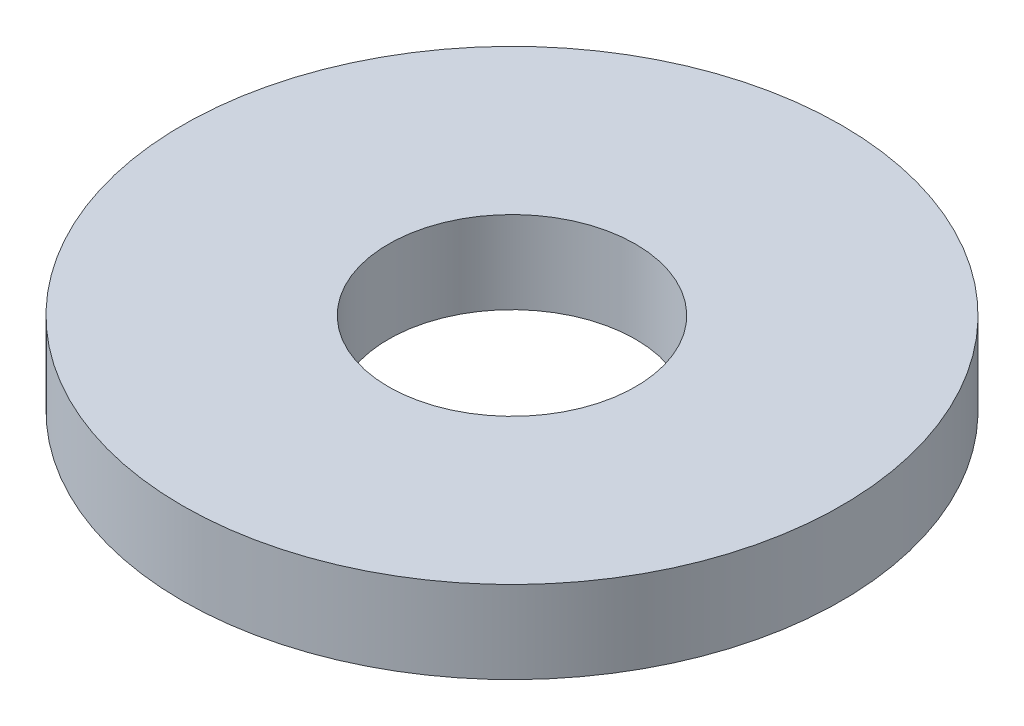
ISO-10303-21;
HEADER;
FILE_DESCRIPTION(('STEP AP214'),'2;1');
FILE_NAME('part.step','',(''),(''),'','','');
FILE_SCHEMA(('AUTOMOTIVE_DESIGN { 1 0 10303 214 1 1 1 1 }'));
ENDSEC;
DATA;
#1=APPLICATION_CONTEXT('core data for automotive mechanical design processes');
#2=APPLICATION_PROTOCOL_DEFINITION('international standard','automotive_design',2000,#1);
#3=PRODUCT_CONTEXT('',#1,'mechanical');
#4=PRODUCT('Part','Part','',(#3));
#5=PRODUCT_RELATED_PRODUCT_CATEGORY('part','',(#4));
#6=PRODUCT_DEFINITION_FORMATION('','',#4);
#7=PRODUCT_DEFINITION_CONTEXT('part definition',#1,'design');
#8=PRODUCT_DEFINITION('design','',#6,#7);
#9=PRODUCT_DEFINITION_SHAPE('','',#8);
#10=(LENGTH_UNIT() NAMED_UNIT(*) SI_UNIT(.MILLI.,.METRE.));
#11=(NAMED_UNIT(*) PLANE_ANGLE_UNIT() SI_UNIT($,.RADIAN.));
#12=(NAMED_UNIT(*) SI_UNIT($,.STERADIAN.) SOLID_ANGLE_UNIT());
#13=UNCERTAINTY_MEASURE_WITH_UNIT(LENGTH_MEASURE(1.E-05),#10,'distance_accuracy_value','');
#14=(GEOMETRIC_REPRESENTATION_CONTEXT(3) GLOBAL_UNCERTAINTY_ASSIGNED_CONTEXT((#13)) GLOBAL_UNIT_ASSIGNED_CONTEXT((#10,
#11,#12)) REPRESENTATION_CONTEXT('',''));
#15=CARTESIAN_POINT('',(0.,0.,0.));
#16=DIRECTION('',(0.,0.,1.));
#17=DIRECTION('',(1.,0.,0.));
#18=AXIS2_PLACEMENT_3D('',#15,#16,#17);
#19=CARTESIAN_POINT('',(0.,1.,0.));
#20=DIRECTION('',(0.,1.,0.));
#21=DIRECTION('',(0.,0.,1.));
#22=AXIS2_PLACEMENT_3D('',#19,#20,#21);
#23=PLANE('',#22);
#24=CARTESIAN_POINT('',(0.,1.,0.));
#25=DIRECTION('',(0.,1.,0.));
#26=DIRECTION('',(0.,0.,1.));
#27=AXIS2_PLACEMENT_3D('',#24,#25,#26);
#28=CIRCLE('',#27,4.);
#29=CARTESIAN_POINT('',(0.,1.,4.));
#30=VERTEX_POINT('',#29);
#31=EDGE_CURVE('E10',#30,#30,#28,.T.);
#32=ORIENTED_EDGE('',*,*,#31,.T.);
#33=EDGE_LOOP('',(#32));
#34=FACE_BOUND('',#33,.T.);
#35=CARTESIAN_POINT('',(0.,1.,0.));
#36=DIRECTION('',(0.,1.,0.));
#37=DIRECTION('',(0.,0.,1.));
#38=AXIS2_PLACEMENT_3D('',#35,#36,#37);
#39=CIRCLE('',#38,1.5);
#40=CARTESIAN_POINT('',(0.,1.,1.5));
#41=VERTEX_POINT('',#40);
#42=EDGE_CURVE('E42',#41,#41,#39,.T.);
#43=ORIENTED_EDGE('',*,*,#42,.F.);
#44=EDGE_LOOP('',(#43));
#45=FACE_BOUND('',#44,.T.);
#46=ADVANCED_FACE('F31',(#34,#45),#23,.T.);
#47=CARTESIAN_POINT('',(0.,0.,0.));
#48=DIRECTION('',(0.,1.,0.));
#49=DIRECTION('',(0.,0.,1.));
#50=AXIS2_PLACEMENT_3D('',#47,#48,#49);
#51=PLANE('',#50);
#52=CARTESIAN_POINT('',(0.,0.,0.));
#53=DIRECTION('',(0.,1.,0.));
#54=DIRECTION('',(0.,0.,1.));
#55=AXIS2_PLACEMENT_3D('',#52,#53,#54);
#56=CIRCLE('',#55,4.);
#57=CARTESIAN_POINT('',(0.,0.,4.));
#58=VERTEX_POINT('',#57);
#59=EDGE_CURVE('E35',#58,#58,#56,.T.);
#60=ORIENTED_EDGE('',*,*,#59,.F.);
#61=EDGE_LOOP('',(#60));
#62=FACE_BOUND('',#61,.T.);
#63=CARTESIAN_POINT('',(0.,0.,0.));
#64=DIRECTION('',(0.,1.,0.));
#65=DIRECTION('',(0.,0.,1.));
#66=AXIS2_PLACEMENT_3D('',#63,#64,#65);
#67=CIRCLE('',#66,1.5);
#68=CARTESIAN_POINT('',(0.,0.,1.5));
#69=VERTEX_POINT('',#68);
#70=EDGE_CURVE('E44',#69,#69,#67,.T.);
#71=ORIENTED_EDGE('',*,*,#70,.T.);
#72=EDGE_LOOP('',(#71));
#73=FACE_BOUND('',#72,.T.);
#74=ADVANCED_FACE('F54',(#62,#73),#51,.F.);
#75=CARTESIAN_POINT('',(0.,1.,0.));
#76=DIRECTION('',(0.,-1.,0.));
#77=DIRECTION('',(0.,0.,-1.));
#78=AXIS2_PLACEMENT_3D('',#75,#76,#77);
#79=CYLINDRICAL_SURFACE('',#78,4.);
#80=ORIENTED_EDGE('',*,*,#31,.F.);
#81=EDGE_LOOP('',(#80));
#82=FACE_BOUND('',#81,.T.);
#83=ORIENTED_EDGE('',*,*,#59,.T.);
#84=EDGE_LOOP('',(#83));
#85=FACE_BOUND('',#84,.T.);
#86=ADVANCED_FACE('F33',(#82,#85),#79,.T.);
#87=CARTESIAN_POINT('',(0.,1.,0.));
#88=DIRECTION('',(0.,-1.,0.));
#89=DIRECTION('',(0.,0.,-1.));
#90=AXIS2_PLACEMENT_3D('',#87,#88,#89);
#91=CYLINDRICAL_SURFACE('',#90,1.5);
#92=ORIENTED_EDGE('',*,*,#42,.T.);
#93=EDGE_LOOP('',(#92));
#94=FACE_BOUND('',#93,.T.);
#95=ORIENTED_EDGE('',*,*,#70,.F.);
#96=EDGE_LOOP('',(#95));
#97=FACE_BOUND('',#96,.T.);
#98=ADVANCED_FACE('F50',(#94,#97),#91,.F.);
#99=CLOSED_SHELL('',(#46,#74,#86,#98));
#100=MANIFOLD_SOLID_BREP('B2',#99);
#101=ADVANCED_BREP_SHAPE_REPRESENTATION('',(#18,#100),#14);
#102=SHAPE_DEFINITION_REPRESENTATION(#9,#101);
ENDSEC;
END-ISO-10303-21;
